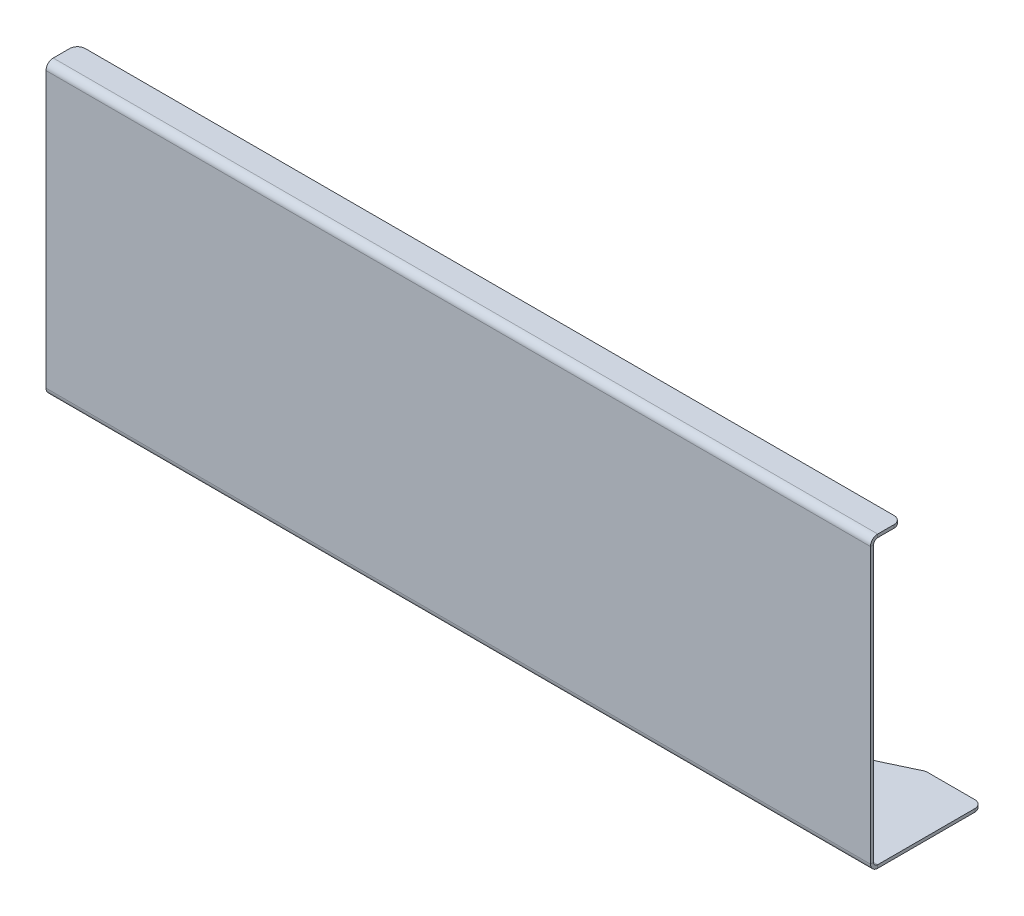
ISO-10303-21;
HEADER;
FILE_DESCRIPTION(('STEP AP214'),'2;1');
FILE_NAME('part.step','',(''),(''),'','','');
FILE_SCHEMA(('AUTOMOTIVE_DESIGN { 1 0 10303 214 1 1 1 1 }'));
ENDSEC;
DATA;
#1=APPLICATION_CONTEXT('core data for automotive mechanical design processes');
#2=APPLICATION_PROTOCOL_DEFINITION('international standard','automotive_design',2000,#1);
#3=PRODUCT_CONTEXT('',#1,'mechanical');
#4=PRODUCT('Part','Part','',(#3));
#5=PRODUCT_RELATED_PRODUCT_CATEGORY('part','',(#4));
#6=PRODUCT_DEFINITION_FORMATION('','',#4);
#7=PRODUCT_DEFINITION_CONTEXT('part definition',#1,'design');
#8=PRODUCT_DEFINITION('design','',#6,#7);
#9=PRODUCT_DEFINITION_SHAPE('','',#8);
#10=(LENGTH_UNIT() NAMED_UNIT(*) SI_UNIT(.MILLI.,.METRE.));
#11=(NAMED_UNIT(*) PLANE_ANGLE_UNIT() SI_UNIT($,.RADIAN.));
#12=(NAMED_UNIT(*) SI_UNIT($,.STERADIAN.) SOLID_ANGLE_UNIT());
#13=UNCERTAINTY_MEASURE_WITH_UNIT(LENGTH_MEASURE(1.E-05),#10,'distance_accuracy_value','');
#14=(GEOMETRIC_REPRESENTATION_CONTEXT(3) GLOBAL_UNCERTAINTY_ASSIGNED_CONTEXT((#13)) GLOBAL_UNIT_ASSIGNED_CONTEXT((#10,
#11,#12)) REPRESENTATION_CONTEXT('',''));
#15=CARTESIAN_POINT('',(0.,0.,0.));
#16=DIRECTION('',(0.,0.,1.));
#17=DIRECTION('',(1.,0.,0.));
#18=AXIS2_PLACEMENT_3D('',#15,#16,#17);
#19=CARTESIAN_POINT('',(-262.,4.60000000000005,-2.));
#20=DIRECTION('',(-1.,0.,0.));
#21=DIRECTION('',(0.,0.,1.));
#22=AXIS2_PLACEMENT_3D('',#19,#20,#21);
#23=PLANE('',#22);
#24=DIRECTION('',(0.,0.,-1.));
#25=VECTOR('',#24,1.);
#26=CARTESIAN_POINT('',(-262.,2.,0.));
#27=LINE('',#26,#25);
#28=CARTESIAN_POINT('',(-262.,2.,-4.60000000000005));
#29=VERTEX_POINT('',#28);
#30=CARTESIAN_POINT('',(-262.,2.,-66.2813416123875));
#31=VERTEX_POINT('',#30);
#32=EDGE_CURVE('E197',#29,#31,#27,.T.);
#33=ORIENTED_EDGE('',*,*,#32,.T.);
#34=DIRECTION('',(0.,-1.,0.));
#35=VECTOR('',#34,1.);
#36=CARTESIAN_POINT('',(-262.,4.60000000000005,-66.2813416123875));
#37=LINE('',#36,#35);
#38=CARTESIAN_POINT('',(-262.,0.,-66.2813416123875));
#39=VERTEX_POINT('',#38);
#40=EDGE_CURVE('E312',#31,#39,#37,.T.);
#41=ORIENTED_EDGE('',*,*,#40,.T.);
#42=DIRECTION('',(0.,0.,-1.));
#43=VECTOR('',#42,1.);
#44=CARTESIAN_POINT('',(-262.,0.,0.));
#45=LINE('',#44,#43);
#46=CARTESIAN_POINT('',(-262.,0.,-4.60000000000005));
#47=VERTEX_POINT('',#46);
#48=EDGE_CURVE('E231',#47,#39,#45,.T.);
#49=ORIENTED_EDGE('',*,*,#48,.F.);
#50=DIRECTION('',(0.,1.,0.));
#51=VECTOR('',#50,1.);
#52=CARTESIAN_POINT('',(-262.,0.,-4.60000000000005));
#53=LINE('',#52,#51);
#54=EDGE_CURVE('E188',#47,#29,#53,.T.);
#55=ORIENTED_EDGE('',*,*,#54,.T.);
#56=EDGE_LOOP('',(#33,#41,#49,#55));
#57=FACE_BOUND('',#56,.T.);
#58=ADVANCED_FACE('F38',(#57),#23,.T.);
#59=CARTESIAN_POINT('',(262.,4.60000000000005,-4.60000000000005));
#60=DIRECTION('',(1.,0.,0.));
#61=DIRECTION('',(0.,0.,-1.));
#62=AXIS2_PLACEMENT_3D('',#59,#60,#61);
#63=PLANE('',#62);
#64=DIRECTION('',(0.,0.,-1.));
#65=VECTOR('',#64,1.);
#66=CARTESIAN_POINT('',(262.,0.,0.));
#67=LINE('',#66,#65);
#68=CARTESIAN_POINT('',(262.,0.,-4.60000000000005));
#69=VERTEX_POINT('',#68);
#70=CARTESIAN_POINT('',(262.,0.,-66.2813416123875));
#71=VERTEX_POINT('',#70);
#72=EDGE_CURVE('E206',#69,#71,#67,.T.);
#73=ORIENTED_EDGE('',*,*,#72,.T.);
#74=DIRECTION('',(0.,-1.,0.));
#75=VECTOR('',#74,1.);
#76=CARTESIAN_POINT('',(262.,4.60000000000005,-66.2813416123875));
#77=LINE('',#76,#75);
#78=CARTESIAN_POINT('',(262.,2.,-66.2813416123875));
#79=VERTEX_POINT('',#78);
#80=EDGE_CURVE('E11',#71,#79,#77,.F.);
#81=ORIENTED_EDGE('',*,*,#80,.T.);
#82=DIRECTION('',(0.,0.,-1.));
#83=VECTOR('',#82,1.);
#84=CARTESIAN_POINT('',(262.,2.,0.));
#85=LINE('',#84,#83);
#86=CARTESIAN_POINT('',(262.,2.,-4.60000000000005));
#87=VERTEX_POINT('',#86);
#88=EDGE_CURVE('E195',#87,#79,#85,.T.);
#89=ORIENTED_EDGE('',*,*,#88,.F.);
#90=DIRECTION('',(0.,-1.,0.));
#91=VECTOR('',#90,1.);
#92=CARTESIAN_POINT('',(262.,2.,-4.60000000000005));
#93=LINE('',#92,#91);
#94=EDGE_CURVE('E175',#87,#69,#93,.T.);
#95=ORIENTED_EDGE('',*,*,#94,.T.);
#96=EDGE_LOOP('',(#73,#81,#89,#95));
#97=FACE_BOUND('',#96,.T.);
#98=ADVANCED_FACE('F204',(#97),#63,.T.);
#99=CARTESIAN_POINT('',(262.,4.60000000000005,0.));
#100=DIRECTION('',(1.,0.,0.));
#101=DIRECTION('',(0.,0.,-1.));
#102=AXIS2_PLACEMENT_3D('',#99,#100,#101);
#103=PLANE('',#102);
#104=DIRECTION('',(0.,0.,-1.));
#105=VECTOR('',#104,1.);
#106=CARTESIAN_POINT('',(262.,4.60000000000005,0.));
#107=LINE('',#106,#105);
#108=CARTESIAN_POINT('',(262.,4.60000000000005,0.));
#109=VERTEX_POINT('',#108);
#110=CARTESIAN_POINT('',(262.,4.60000000000005,-2.));
#111=VERTEX_POINT('',#110);
#112=EDGE_CURVE('E187',#109,#111,#107,.T.);
#113=ORIENTED_EDGE('',*,*,#112,.F.);
#114=CARTESIAN_POINT('',(262.,4.60000000000005,-4.60000000000005));
#115=DIRECTION('',(1.,0.,0.));
#116=DIRECTION('',(0.,0.,-1.));
#117=AXIS2_PLACEMENT_3D('',#114,#115,#116);
#118=CIRCLE('',#117,4.6);
#119=EDGE_CURVE('E182',#109,#69,#118,.T.);
#120=ORIENTED_EDGE('',*,*,#119,.T.);
#121=ORIENTED_EDGE('',*,*,#94,.F.);
#122=CARTESIAN_POINT('',(262.,4.60000000000005,-4.60000000000005));
#123=DIRECTION('',(1.,0.,0.));
#124=DIRECTION('',(0.,0.,-1.));
#125=AXIS2_PLACEMENT_3D('',#122,#123,#124);
#126=CIRCLE('',#125,2.6);
#127=EDGE_CURVE('E179',#111,#87,#126,.T.);
#128=ORIENTED_EDGE('',*,*,#127,.F.);
#129=EDGE_LOOP('',(#113,#120,#121,#128));
#130=FACE_BOUND('',#129,.T.);
#131=ADVANCED_FACE('F177',(#130),#103,.T.);
#132=CARTESIAN_POINT('',(262.,2.,-4.60000000000005));
#133=DIRECTION('',(1.,0.,0.));
#134=DIRECTION('',(0.,0.,-1.));
#135=AXIS2_PLACEMENT_3D('',#132,#133,#134);
#136=PLANE('',#135);
#137=DIRECTION('',(0.,-1.,0.));
#138=VECTOR('',#137,1.);
#139=CARTESIAN_POINT('',(262.,0.,0.));
#140=LINE('',#139,#138);
#141=CARTESIAN_POINT('',(262.,179.4,0.));
#142=VERTEX_POINT('',#141);
#143=EDGE_CURVE('E226',#142,#109,#140,.T.);
#144=ORIENTED_EDGE('',*,*,#143,.T.);
#145=ORIENTED_EDGE('',*,*,#112,.T.);
#146=DIRECTION('',(0.,1.,0.));
#147=VECTOR('',#146,1.);
#148=CARTESIAN_POINT('',(262.,0.,-2.));
#149=LINE('',#148,#147);
#150=CARTESIAN_POINT('',(262.,179.4,-2.));
#151=VERTEX_POINT('',#150);
#152=EDGE_CURVE('E211',#151,#111,#149,.F.);
#153=ORIENTED_EDGE('',*,*,#152,.F.);
#154=DIRECTION('',(0.,0.,1.));
#155=VECTOR('',#154,1.);
#156=CARTESIAN_POINT('',(262.,179.4,-2.));
#157=LINE('',#156,#155);
#158=EDGE_CURVE('E285',#151,#142,#157,.T.);
#159=ORIENTED_EDGE('',*,*,#158,.T.);
#160=EDGE_LOOP('',(#144,#145,#153,#159));
#161=FACE_BOUND('',#160,.T.);
#162=ADVANCED_FACE('F381',(#161),#136,.T.);
#163=CARTESIAN_POINT('',(-262.,0.,-4.60000000000005));
#164=DIRECTION('',(-1.,0.,0.));
#165=DIRECTION('',(0.,0.,1.));
#166=AXIS2_PLACEMENT_3D('',#163,#164,#165);
#167=PLANE('',#166);
#168=ORIENTED_EDGE('',*,*,#54,.F.);
#169=CARTESIAN_POINT('',(-262.,4.60000000000005,-4.60000000000005));
#170=DIRECTION('',(1.,0.,0.));
#171=DIRECTION('',(0.,0.,-1.));
#172=AXIS2_PLACEMENT_3D('',#169,#170,#171);
#173=CIRCLE('',#172,4.6);
#174=CARTESIAN_POINT('',(-262.,4.60000000000005,0.));
#175=VERTEX_POINT('',#174);
#176=EDGE_CURVE('E254',#175,#47,#173,.T.);
#177=ORIENTED_EDGE('',*,*,#176,.F.);
#178=DIRECTION('',(0.,0.,1.));
#179=VECTOR('',#178,1.);
#180=CARTESIAN_POINT('',(-262.,4.60000000000005,-2.));
#181=LINE('',#180,#179);
#182=CARTESIAN_POINT('',(-262.,4.60000000000005,-2.));
#183=VERTEX_POINT('',#182);
#184=EDGE_CURVE('E290',#183,#175,#181,.T.);
#185=ORIENTED_EDGE('',*,*,#184,.F.);
#186=CARTESIAN_POINT('',(-262.,4.60000000000005,-4.60000000000005));
#187=DIRECTION('',(1.,0.,0.));
#188=DIRECTION('',(0.,0.,-1.));
#189=AXIS2_PLACEMENT_3D('',#186,#187,#188);
#190=CIRCLE('',#189,2.6);
#191=EDGE_CURVE('E236',#183,#29,#190,.T.);
#192=ORIENTED_EDGE('',*,*,#191,.T.);
#193=EDGE_LOOP('',(#168,#177,#185,#192));
#194=FACE_BOUND('',#193,.T.);
#195=ADVANCED_FACE('F378',(#194),#167,.T.);
#196=CARTESIAN_POINT('',(262.,184.,-4.60000000000005));
#197=DIRECTION('',(1.,0.,0.));
#198=DIRECTION('',(0.,0.,-1.));
#199=AXIS2_PLACEMENT_3D('',#196,#197,#198);
#200=PLANE('',#199);
#201=DIRECTION('',(0.,-1.,0.));
#202=VECTOR('',#201,1.);
#203=CARTESIAN_POINT('',(262.,184.,-4.60000000000005));
#204=LINE('',#203,#202);
#205=CARTESIAN_POINT('',(262.,184.,-4.60000000000005));
#206=VERTEX_POINT('',#205);
#207=CARTESIAN_POINT('',(262.,182.,-4.60000000000005));
#208=VERTEX_POINT('',#207);
#209=EDGE_CURVE('E287',#206,#208,#204,.T.);
#210=ORIENTED_EDGE('',*,*,#209,.F.);
#211=CARTESIAN_POINT('',(262.,179.4,-4.60000000000005));
#212=DIRECTION('',(1.,0.,0.));
#213=DIRECTION('',(0.,0.,-1.));
#214=AXIS2_PLACEMENT_3D('',#211,#212,#213);
#215=CIRCLE('',#214,4.6);
#216=EDGE_CURVE('E223',#206,#142,#215,.T.);
#217=ORIENTED_EDGE('',*,*,#216,.T.);
#218=ORIENTED_EDGE('',*,*,#158,.F.);
#219=CARTESIAN_POINT('',(262.,179.4,-4.60000000000005));
#220=DIRECTION('',(1.,0.,0.));
#221=DIRECTION('',(0.,0.,-1.));
#222=AXIS2_PLACEMENT_3D('',#219,#220,#221);
#223=CIRCLE('',#222,2.6);
#224=EDGE_CURVE('E213',#208,#151,#223,.T.);
#225=ORIENTED_EDGE('',*,*,#224,.F.);
#226=EDGE_LOOP('',(#210,#217,#218,#225));
#227=FACE_BOUND('',#226,.T.);
#228=ADVANCED_FACE('F376',(#227),#200,.T.);
#229=CARTESIAN_POINT('',(262.,179.4,-2.));
#230=DIRECTION('',(1.,0.,0.));
#231=DIRECTION('',(0.,0.,-1.));
#232=AXIS2_PLACEMENT_3D('',#229,#230,#231);
#233=PLANE('',#232);
#234=DIRECTION('',(0.,0.,-1.));
#235=VECTOR('',#234,1.);
#236=CARTESIAN_POINT('',(262.,182.,0.));
#237=LINE('',#236,#235);
#238=CARTESIAN_POINT('',(262.,182.,-15.));
#239=VERTEX_POINT('',#238);
#240=EDGE_CURVE('E219',#239,#208,#237,.F.);
#241=ORIENTED_EDGE('',*,*,#240,.F.);
#242=DIRECTION('',(0.,-1.,0.));
#243=VECTOR('',#242,1.);
#244=CARTESIAN_POINT('',(262.,179.4,-15.));
#245=LINE('',#244,#243);
#246=CARTESIAN_POINT('',(262.,184.,-15.));
#247=VERTEX_POINT('',#246);
#248=EDGE_CURVE('E303',#239,#247,#245,.F.);
#249=ORIENTED_EDGE('',*,*,#248,.T.);
#250=DIRECTION('',(0.,0.,1.));
#251=VECTOR('',#250,1.);
#252=CARTESIAN_POINT('',(262.,184.,0.));
#253=LINE('',#252,#251);
#254=EDGE_CURVE('E221',#247,#206,#253,.T.);
#255=ORIENTED_EDGE('',*,*,#254,.T.);
#256=ORIENTED_EDGE('',*,*,#209,.T.);
#257=EDGE_LOOP('',(#241,#249,#255,#256));
#258=FACE_BOUND('',#257,.T.);
#259=ADVANCED_FACE('F483',(#258),#233,.T.);
#260=CARTESIAN_POINT('',(-262.,179.4,0.));
#261=DIRECTION('',(-1.,0.,0.));
#262=DIRECTION('',(0.,0.,1.));
#263=AXIS2_PLACEMENT_3D('',#260,#261,#262);
#264=PLANE('',#263);
#265=DIRECTION('',(0.,0.,-1.));
#266=VECTOR('',#265,1.);
#267=CARTESIAN_POINT('',(-262.,179.4,0.));
#268=LINE('',#267,#266);
#269=CARTESIAN_POINT('',(-262.,179.4,0.));
#270=VERTEX_POINT('',#269);
#271=CARTESIAN_POINT('',(-262.,179.4,-2.));
#272=VERTEX_POINT('',#271);
#273=EDGE_CURVE('E283',#270,#272,#268,.T.);
#274=ORIENTED_EDGE('',*,*,#273,.F.);
#275=CARTESIAN_POINT('',(-262.,179.4,-4.60000000000005));
#276=DIRECTION('',(1.,0.,0.));
#277=DIRECTION('',(0.,0.,-1.));
#278=AXIS2_PLACEMENT_3D('',#275,#276,#277);
#279=CIRCLE('',#278,4.6);
#280=CARTESIAN_POINT('',(-262.,184.,-4.60000000000005));
#281=VERTEX_POINT('',#280);
#282=EDGE_CURVE('E248',#281,#270,#279,.T.);
#283=ORIENTED_EDGE('',*,*,#282,.F.);
#284=DIRECTION('',(0.,1.,0.));
#285=VECTOR('',#284,1.);
#286=CARTESIAN_POINT('',(-262.,182.,-4.60000000000005));
#287=LINE('',#286,#285);
#288=CARTESIAN_POINT('',(-262.,182.,-4.60000000000005));
#289=VERTEX_POINT('',#288);
#290=EDGE_CURVE('E201',#289,#281,#287,.T.);
#291=ORIENTED_EDGE('',*,*,#290,.F.);
#292=CARTESIAN_POINT('',(-262.,179.4,-4.60000000000005));
#293=DIRECTION('',(1.,0.,0.));
#294=DIRECTION('',(0.,0.,-1.));
#295=AXIS2_PLACEMENT_3D('',#292,#293,#294);
#296=CIRCLE('',#295,2.6);
#297=EDGE_CURVE('E241',#289,#272,#296,.T.);
#298=ORIENTED_EDGE('',*,*,#297,.T.);
#299=EDGE_LOOP('',(#274,#283,#291,#298));
#300=FACE_BOUND('',#299,.T.);
#301=ADVANCED_FACE('F480',(#300),#264,.T.);
#302=CARTESIAN_POINT('',(-262.,182.,-4.60000000000005));
#303=DIRECTION('',(-1.,0.,0.));
#304=DIRECTION('',(0.,0.,1.));
#305=AXIS2_PLACEMENT_3D('',#302,#303,#304);
#306=PLANE('',#305);
#307=DIRECTION('',(0.,-1.,0.));
#308=VECTOR('',#307,1.);
#309=CARTESIAN_POINT('',(-262.,0.,0.));
#310=LINE('',#309,#308);
#311=EDGE_CURVE('E251',#270,#175,#310,.T.);
#312=ORIENTED_EDGE('',*,*,#311,.F.);
#313=ORIENTED_EDGE('',*,*,#273,.T.);
#314=DIRECTION('',(0.,1.,0.));
#315=VECTOR('',#314,1.);
#316=CARTESIAN_POINT('',(-262.,0.,-2.));
#317=LINE('',#316,#315);
#318=EDGE_CURVE('E238',#272,#183,#317,.F.);
#319=ORIENTED_EDGE('',*,*,#318,.T.);
#320=ORIENTED_EDGE('',*,*,#184,.T.);
#321=EDGE_LOOP('',(#312,#313,#319,#320));
#322=FACE_BOUND('',#321,.T.);
#323=ADVANCED_FACE('F477',(#322),#306,.T.);
#324=CARTESIAN_POINT('',(262.,0.,0.));
#325=DIRECTION('',(0.,1.,0.));
#326=DIRECTION('',(0.,0.,1.));
#327=AXIS2_PLACEMENT_3D('',#324,#325,#326);
#328=PLANE('',#327);
#329=ORIENTED_EDGE('',*,*,#48,.T.);
#330=CARTESIAN_POINT('',(-257.,0.,-66.2813416123875));
#331=DIRECTION('',(0.,1.,0.));
#332=DIRECTION('',(0.,0.,1.));
#333=AXIS2_PLACEMENT_3D('',#330,#331,#332);
#334=CIRCLE('',#333,5.);
#335=CARTESIAN_POINT('',(-257.,0.,-71.2813416123875));
#336=VERTEX_POINT('',#335);
#337=EDGE_CURVE('E321',#39,#336,#334,.F.);
#338=ORIENTED_EDGE('',*,*,#337,.T.);
#339=DIRECTION('',(1.,0.,0.));
#340=VECTOR('',#339,1.);
#341=CARTESIAN_POINT('',(-262.,0.,-71.2813416123875));
#342=LINE('',#341,#340);
#343=CARTESIAN_POINT('',(-226.953887564455,0.,-71.2813416123875));
#344=VERTEX_POINT('',#343);
#345=EDGE_CURVE('E357',#336,#344,#342,.T.);
#346=ORIENTED_EDGE('',*,*,#345,.T.);
#347=CARTESIAN_POINT('',(-226.953887564455,0.,-66.2813416123874));
#348=DIRECTION('',(0.,1.,0.));
#349=DIRECTION('',(0.,0.,1.));
#350=AXIS2_PLACEMENT_3D('',#347,#348,#349);
#351=CIRCLE('',#350,5.);
#352=CARTESIAN_POINT('',(-224.728849451078,0.,-70.7589755181483));
#353=VERTEX_POINT('',#352);
#354=EDGE_CURVE('E319',#344,#353,#351,.F.);
#355=ORIENTED_EDGE('',*,*,#354,.T.);
#356=CARTESIAN_POINT('',(0.,0.,-523.));
#357=DIRECTION('',(0.,1.,0.));
#358=DIRECTION('',(0.,0.,1.));
#359=AXIS2_PLACEMENT_3D('',#356,#357,#358);
#360=CIRCLE('',#359,505.);
#361=CARTESIAN_POINT('',(224.728849451078,0.,-70.7589755181484));
#362=VERTEX_POINT('',#361);
#363=EDGE_CURVE('E352',#353,#362,#360,.T.);
#364=ORIENTED_EDGE('',*,*,#363,.T.);
#365=CARTESIAN_POINT('',(226.953887564455,0.,-66.2813416123875));
#366=DIRECTION('',(0.,1.,0.));
#367=DIRECTION('',(0.,0.,1.));
#368=AXIS2_PLACEMENT_3D('',#365,#366,#367);
#369=CIRCLE('',#368,5.);
#370=CARTESIAN_POINT('',(226.953887564455,0.,-71.2813416123875));
#371=VERTEX_POINT('',#370);
#372=EDGE_CURVE('E317',#362,#371,#369,.F.);
#373=ORIENTED_EDGE('',*,*,#372,.T.);
#374=DIRECTION('',(1.,0.,0.));
#375=VECTOR('',#374,1.);
#376=CARTESIAN_POINT('',(262.,0.,-71.2813416123875));
#377=LINE('',#376,#375);
#378=CARTESIAN_POINT('',(257.,0.,-71.2813416123875));
#379=VERTEX_POINT('',#378);
#380=EDGE_CURVE('E345',#371,#379,#377,.T.);
#381=ORIENTED_EDGE('',*,*,#380,.T.);
#382=CARTESIAN_POINT('',(257.,0.,-66.2813416123875));
#383=DIRECTION('',(0.,1.,0.));
#384=DIRECTION('',(0.,0.,1.));
#385=AXIS2_PLACEMENT_3D('',#382,#383,#384);
#386=CIRCLE('',#385,5.);
#387=EDGE_CURVE('E315',#379,#71,#386,.F.);
#388=ORIENTED_EDGE('',*,*,#387,.T.);
#389=ORIENTED_EDGE('',*,*,#72,.F.);
#390=DIRECTION('',(-1.,0.,0.));
#391=VECTOR('',#390,1.);
#392=CARTESIAN_POINT('',(262.,0.,-4.60000000000005));
#393=LINE('',#392,#391);
#394=EDGE_CURVE('E230',#69,#47,#393,.T.);
#395=ORIENTED_EDGE('',*,*,#394,.T.);
#396=EDGE_LOOP('',(#329,#338,#346,#355,#364,#373,#381,#388,#389,#395));
#397=FACE_BOUND('',#396,.T.);
#398=ADVANCED_FACE('F348',(#397),#328,.F.);
#399=CARTESIAN_POINT('',(262.,2.,0.));
#400=DIRECTION('',(0.,1.,0.));
#401=DIRECTION('',(0.,0.,1.));
#402=AXIS2_PLACEMENT_3D('',#399,#400,#401);
#403=PLANE('',#402);
#404=DIRECTION('',(1.,0.,0.));
#405=VECTOR('',#404,1.);
#406=CARTESIAN_POINT('',(-262.,2.,-71.2813416123875));
#407=LINE('',#406,#405);
#408=CARTESIAN_POINT('',(-257.,2.,-71.2813416123875));
#409=VERTEX_POINT('',#408);
#410=CARTESIAN_POINT('',(-226.953887564455,2.,-71.2813416123875));
#411=VERTEX_POINT('',#410);
#412=EDGE_CURVE('E351',#409,#411,#407,.T.);
#413=ORIENTED_EDGE('',*,*,#412,.F.);
#414=CARTESIAN_POINT('',(-257.,2.,-66.2813416123875));
#415=DIRECTION('',(0.,1.,0.));
#416=DIRECTION('',(0.,0.,1.));
#417=AXIS2_PLACEMENT_3D('',#414,#415,#416);
#418=CIRCLE('',#417,5.);
#419=EDGE_CURVE('E333',#409,#31,#418,.T.);
#420=ORIENTED_EDGE('',*,*,#419,.T.);
#421=ORIENTED_EDGE('',*,*,#32,.F.);
#422=DIRECTION('',(-1.,0.,0.));
#423=VECTOR('',#422,1.);
#424=CARTESIAN_POINT('',(262.,2.,-4.60000000000005));
#425=LINE('',#424,#423);
#426=EDGE_CURVE('E192',#87,#29,#425,.T.);
#427=ORIENTED_EDGE('',*,*,#426,.F.);
#428=ORIENTED_EDGE('',*,*,#88,.T.);
#429=CARTESIAN_POINT('',(257.,2.,-66.2813416123875));
#430=DIRECTION('',(0.,1.,0.));
#431=DIRECTION('',(0.,0.,1.));
#432=AXIS2_PLACEMENT_3D('',#429,#430,#431);
#433=CIRCLE('',#432,5.);
#434=CARTESIAN_POINT('',(257.,2.,-71.2813416123875));
#435=VERTEX_POINT('',#434);
#436=EDGE_CURVE('E53',#79,#435,#433,.T.);
#437=ORIENTED_EDGE('',*,*,#436,.T.);
#438=DIRECTION('',(1.,0.,0.));
#439=VECTOR('',#438,1.);
#440=CARTESIAN_POINT('',(262.,2.,-71.2813416123875));
#441=LINE('',#440,#439);
#442=CARTESIAN_POINT('',(226.953887564455,2.,-71.2813416123875));
#443=VERTEX_POINT('',#442);
#444=EDGE_CURVE('E234',#443,#435,#441,.T.);
#445=ORIENTED_EDGE('',*,*,#444,.F.);
#446=CARTESIAN_POINT('',(226.953887564455,2.,-66.2813416123875));
#447=DIRECTION('',(0.,1.,0.));
#448=DIRECTION('',(0.,0.,1.));
#449=AXIS2_PLACEMENT_3D('',#446,#447,#448);
#450=CIRCLE('',#449,5.);
#451=CARTESIAN_POINT('',(224.728849451078,2.,-70.7589755181484));
#452=VERTEX_POINT('',#451);
#453=EDGE_CURVE('E329',#443,#452,#450,.T.);
#454=ORIENTED_EDGE('',*,*,#453,.T.);
#455=CARTESIAN_POINT('',(0.,2.,-523.));
#456=DIRECTION('',(0.,1.,0.));
#457=DIRECTION('',(0.,0.,1.));
#458=AXIS2_PLACEMENT_3D('',#455,#456,#457);
#459=CIRCLE('',#458,505.);
#460=CARTESIAN_POINT('',(-224.728849451078,2.,-70.7589755181483));
#461=VERTEX_POINT('',#460);
#462=EDGE_CURVE('E355',#461,#452,#459,.T.);
#463=ORIENTED_EDGE('',*,*,#462,.F.);
#464=CARTESIAN_POINT('',(-226.953887564455,2.,-66.2813416123874));
#465=DIRECTION('',(0.,1.,0.));
#466=DIRECTION('',(0.,0.,1.));
#467=AXIS2_PLACEMENT_3D('',#464,#465,#466);
#468=CIRCLE('',#467,5.);
#469=EDGE_CURVE('E331',#461,#411,#468,.T.);
#470=ORIENTED_EDGE('',*,*,#469,.T.);
#471=EDGE_LOOP('',(#413,#420,#421,#427,#428,#437,#445,#454,#463,#470));
#472=FACE_BOUND('',#471,.T.);
#473=ADVANCED_FACE('F194',(#472),#403,.T.);
#474=CARTESIAN_POINT('',(262.,4.60000000000005,-4.60000000000005));
#475=DIRECTION('',(-1.,0.,0.));
#476=DIRECTION('',(0.,0.,1.));
#477=AXIS2_PLACEMENT_3D('',#474,#475,#476);
#478=CYLINDRICAL_SURFACE('',#477,2.6);
#479=ORIENTED_EDGE('',*,*,#191,.F.);
#480=DIRECTION('',(-1.,0.,0.));
#481=VECTOR('',#480,1.);
#482=CARTESIAN_POINT('',(262.,4.60000000000005,-2.));
#483=LINE('',#482,#481);
#484=EDGE_CURVE('E202',#111,#183,#483,.T.);
#485=ORIENTED_EDGE('',*,*,#484,.F.);
#486=ORIENTED_EDGE('',*,*,#127,.T.);
#487=ORIENTED_EDGE('',*,*,#426,.T.);
#488=EDGE_LOOP('',(#479,#485,#486,#487));
#489=FACE_BOUND('',#488,.T.);
#490=ADVANCED_FACE('F209',(#489),#478,.F.);
#491=CARTESIAN_POINT('',(262.,0.,-2.));
#492=DIRECTION('',(0.,0.,-1.));
#493=DIRECTION('',(-1.,0.,0.));
#494=AXIS2_PLACEMENT_3D('',#491,#492,#493);
#495=PLANE('',#494);
#496=ORIENTED_EDGE('',*,*,#318,.F.);
#497=DIRECTION('',(-1.,0.,0.));
#498=VECTOR('',#497,1.);
#499=CARTESIAN_POINT('',(262.,179.4,-2.));
#500=LINE('',#499,#498);
#501=EDGE_CURVE('E277',#151,#272,#500,.T.);
#502=ORIENTED_EDGE('',*,*,#501,.F.);
#503=ORIENTED_EDGE('',*,*,#152,.T.);
#504=ORIENTED_EDGE('',*,*,#484,.T.);
#505=EDGE_LOOP('',(#496,#502,#503,#504));
#506=FACE_BOUND('',#505,.T.);
#507=ADVANCED_FACE('F466',(#506),#495,.T.);
#508=CARTESIAN_POINT('',(262.,179.4,-4.60000000000005));
#509=DIRECTION('',(-1.,0.,0.));
#510=DIRECTION('',(0.,0.,1.));
#511=AXIS2_PLACEMENT_3D('',#508,#509,#510);
#512=CYLINDRICAL_SURFACE('',#511,2.6);
#513=ORIENTED_EDGE('',*,*,#297,.F.);
#514=DIRECTION('',(-1.,0.,0.));
#515=VECTOR('',#514,1.);
#516=CARTESIAN_POINT('',(262.,182.,-4.60000000000005));
#517=LINE('',#516,#515);
#518=EDGE_CURVE('E274',#208,#289,#517,.T.);
#519=ORIENTED_EDGE('',*,*,#518,.F.);
#520=ORIENTED_EDGE('',*,*,#224,.T.);
#521=ORIENTED_EDGE('',*,*,#501,.T.);
#522=EDGE_LOOP('',(#513,#519,#520,#521));
#523=FACE_BOUND('',#522,.T.);
#524=ADVANCED_FACE('F462',(#523),#512,.F.);
#525=CARTESIAN_POINT('',(262.,182.,0.));
#526=DIRECTION('',(0.,-1.,0.));
#527=DIRECTION('',(0.,0.,-1.));
#528=AXIS2_PLACEMENT_3D('',#525,#526,#527);
#529=PLANE('',#528);
#530=DIRECTION('',(-1.,0.,0.));
#531=VECTOR('',#530,1.);
#532=CARTESIAN_POINT('',(262.,182.,-20.));
#533=LINE('',#532,#531);
#534=CARTESIAN_POINT('',(257.,182.,-20.));
#535=VERTEX_POINT('',#534);
#536=CARTESIAN_POINT('',(-257.,182.,-20.));
#537=VERTEX_POINT('',#536);
#538=EDGE_CURVE('E271',#535,#537,#533,.T.);
#539=ORIENTED_EDGE('',*,*,#538,.F.);
#540=CARTESIAN_POINT('',(257.,182.,-15.));
#541=DIRECTION('',(0.,-1.,0.));
#542=DIRECTION('',(0.,0.,-1.));
#543=AXIS2_PLACEMENT_3D('',#540,#541,#542);
#544=CIRCLE('',#543,5.);
#545=EDGE_CURVE('E301',#535,#239,#544,.T.);
#546=ORIENTED_EDGE('',*,*,#545,.T.);
#547=ORIENTED_EDGE('',*,*,#240,.T.);
#548=ORIENTED_EDGE('',*,*,#518,.T.);
#549=DIRECTION('',(0.,0.,-1.));
#550=VECTOR('',#549,1.);
#551=CARTESIAN_POINT('',(-262.,182.,0.));
#552=LINE('',#551,#550);
#553=CARTESIAN_POINT('',(-262.,182.,-15.));
#554=VERTEX_POINT('',#553);
#555=EDGE_CURVE('E244',#554,#289,#552,.F.);
#556=ORIENTED_EDGE('',*,*,#555,.F.);
#557=CARTESIAN_POINT('',(-257.,182.,-15.));
#558=DIRECTION('',(0.,-1.,0.));
#559=DIRECTION('',(0.,0.,-1.));
#560=AXIS2_PLACEMENT_3D('',#557,#558,#559);
#561=CIRCLE('',#560,5.);
#562=EDGE_CURVE('E299',#554,#537,#561,.T.);
#563=ORIENTED_EDGE('',*,*,#562,.T.);
#564=EDGE_LOOP('',(#539,#546,#547,#548,#556,#563));
#565=FACE_BOUND('',#564,.T.);
#566=ADVANCED_FACE('F458',(#565),#529,.T.);
#567=CARTESIAN_POINT('',(262.,184.,-20.));
#568=DIRECTION('',(0.,0.,-1.));
#569=DIRECTION('',(-1.,0.,0.));
#570=AXIS2_PLACEMENT_3D('',#567,#568,#569);
#571=PLANE('',#570);
#572=DIRECTION('',(-1.,0.,0.));
#573=VECTOR('',#572,1.);
#574=CARTESIAN_POINT('',(262.,184.,-20.));
#575=LINE('',#574,#573);
#576=CARTESIAN_POINT('',(257.,184.,-20.));
#577=VERTEX_POINT('',#576);
#578=CARTESIAN_POINT('',(-257.,184.,-20.));
#579=VERTEX_POINT('',#578);
#580=EDGE_CURVE('E268',#577,#579,#575,.T.);
#581=ORIENTED_EDGE('',*,*,#580,.F.);
#582=DIRECTION('',(0.,-1.,0.));
#583=VECTOR('',#582,1.);
#584=CARTESIAN_POINT('',(257.,184.,-20.));
#585=LINE('',#584,#583);
#586=EDGE_CURVE('E296',#577,#535,#585,.T.);
#587=ORIENTED_EDGE('',*,*,#586,.T.);
#588=ORIENTED_EDGE('',*,*,#538,.T.);
#589=DIRECTION('',(0.,-1.,0.));
#590=VECTOR('',#589,1.);
#591=CARTESIAN_POINT('',(-257.,184.,-20.));
#592=LINE('',#591,#590);
#593=EDGE_CURVE('E294',#537,#579,#592,.F.);
#594=ORIENTED_EDGE('',*,*,#593,.T.);
#595=EDGE_LOOP('',(#581,#587,#588,#594));
#596=FACE_BOUND('',#595,.T.);
#597=ADVANCED_FACE('F454',(#596),#571,.T.);
#598=CARTESIAN_POINT('',(262.,184.,0.));
#599=DIRECTION('',(0.,-1.,0.));
#600=DIRECTION('',(0.,0.,-1.));
#601=AXIS2_PLACEMENT_3D('',#598,#599,#600);
#602=PLANE('',#601);
#603=ORIENTED_EDGE('',*,*,#254,.F.);
#604=CARTESIAN_POINT('',(257.,184.,-15.));
#605=DIRECTION('',(0.,-1.,0.));
#606=DIRECTION('',(0.,0.,-1.));
#607=AXIS2_PLACEMENT_3D('',#604,#605,#606);
#608=CIRCLE('',#607,5.);
#609=EDGE_CURVE('E307',#247,#577,#608,.F.);
#610=ORIENTED_EDGE('',*,*,#609,.T.);
#611=ORIENTED_EDGE('',*,*,#580,.T.);
#612=CARTESIAN_POINT('',(-257.,184.,-15.));
#613=DIRECTION('',(0.,-1.,0.));
#614=DIRECTION('',(0.,0.,-1.));
#615=AXIS2_PLACEMENT_3D('',#612,#613,#614);
#616=CIRCLE('',#615,5.);
#617=CARTESIAN_POINT('',(-262.,184.,-15.));
#618=VERTEX_POINT('',#617);
#619=EDGE_CURVE('E305',#579,#618,#616,.F.);
#620=ORIENTED_EDGE('',*,*,#619,.T.);
#621=DIRECTION('',(0.,0.,1.));
#622=VECTOR('',#621,1.);
#623=CARTESIAN_POINT('',(-262.,184.,0.));
#624=LINE('',#623,#622);
#625=EDGE_CURVE('E246',#618,#281,#624,.T.);
#626=ORIENTED_EDGE('',*,*,#625,.T.);
#627=DIRECTION('',(-1.,0.,0.));
#628=VECTOR('',#627,1.);
#629=CARTESIAN_POINT('',(262.,184.,-4.60000000000005));
#630=LINE('',#629,#628);
#631=EDGE_CURVE('E265',#206,#281,#630,.T.);
#632=ORIENTED_EDGE('',*,*,#631,.F.);
#633=EDGE_LOOP('',(#603,#610,#611,#620,#626,#632));
#634=FACE_BOUND('',#633,.T.);
#635=ADVANCED_FACE('F450',(#634),#602,.F.);
#636=CARTESIAN_POINT('',(262.,179.4,-4.60000000000005));
#637=DIRECTION('',(-1.,0.,0.));
#638=DIRECTION('',(0.,0.,1.));
#639=AXIS2_PLACEMENT_3D('',#636,#637,#638);
#640=CYLINDRICAL_SURFACE('',#639,4.6);
#641=ORIENTED_EDGE('',*,*,#282,.T.);
#642=DIRECTION('',(-1.,0.,0.));
#643=VECTOR('',#642,1.);
#644=CARTESIAN_POINT('',(262.,179.4,0.));
#645=LINE('',#644,#643);
#646=EDGE_CURVE('E262',#142,#270,#645,.T.);
#647=ORIENTED_EDGE('',*,*,#646,.F.);
#648=ORIENTED_EDGE('',*,*,#216,.F.);
#649=ORIENTED_EDGE('',*,*,#631,.T.);
#650=EDGE_LOOP('',(#641,#647,#648,#649));
#651=FACE_BOUND('',#650,.T.);
#652=ADVANCED_FACE('F446',(#651),#640,.T.);
#653=CARTESIAN_POINT('',(262.,0.,0.));
#654=DIRECTION('',(0.,0.,-1.));
#655=DIRECTION('',(-1.,0.,0.));
#656=AXIS2_PLACEMENT_3D('',#653,#654,#655);
#657=PLANE('',#656);
#658=ORIENTED_EDGE('',*,*,#311,.T.);
#659=DIRECTION('',(-1.,0.,0.));
#660=VECTOR('',#659,1.);
#661=CARTESIAN_POINT('',(262.,4.60000000000005,0.));
#662=LINE('',#661,#660);
#663=EDGE_CURVE('E259',#109,#175,#662,.T.);
#664=ORIENTED_EDGE('',*,*,#663,.F.);
#665=ORIENTED_EDGE('',*,*,#143,.F.);
#666=ORIENTED_EDGE('',*,*,#646,.T.);
#667=EDGE_LOOP('',(#658,#664,#665,#666));
#668=FACE_BOUND('',#667,.T.);
#669=ADVANCED_FACE('F443',(#668),#657,.F.);
#670=CARTESIAN_POINT('',(262.,4.60000000000005,-4.60000000000005));
#671=DIRECTION('',(-1.,0.,0.));
#672=DIRECTION('',(0.,0.,1.));
#673=AXIS2_PLACEMENT_3D('',#670,#671,#672);
#674=CYLINDRICAL_SURFACE('',#673,4.6);
#675=ORIENTED_EDGE('',*,*,#176,.T.);
#676=ORIENTED_EDGE('',*,*,#394,.F.);
#677=ORIENTED_EDGE('',*,*,#119,.F.);
#678=ORIENTED_EDGE('',*,*,#663,.T.);
#679=EDGE_LOOP('',(#675,#676,#677,#678));
#680=FACE_BOUND('',#679,.T.);
#681=ADVANCED_FACE('F419',(#680),#674,.T.);
#682=CARTESIAN_POINT('',(-262.,4.60000000000005,-4.60000000000005));
#683=DIRECTION('',(1.,0.,0.));
#684=DIRECTION('',(0.,0.,-1.));
#685=AXIS2_PLACEMENT_3D('',#682,#683,#684);
#686=PLANE('',#685);
#687=ORIENTED_EDGE('',*,*,#625,.F.);
#688=DIRECTION('',(0.,-1.,0.));
#689=VECTOR('',#688,1.);
#690=CARTESIAN_POINT('',(-262.,182.,-15.));
#691=LINE('',#690,#689);
#692=EDGE_CURVE('E309',#618,#554,#691,.T.);
#693=ORIENTED_EDGE('',*,*,#692,.T.);
#694=ORIENTED_EDGE('',*,*,#555,.T.);
#695=ORIENTED_EDGE('',*,*,#290,.T.);
#696=EDGE_LOOP('',(#687,#693,#694,#695));
#697=FACE_BOUND('',#696,.T.);
#698=ADVANCED_FACE('F435',(#697),#686,.F.);
#699=CARTESIAN_POINT('',(-262.,2.,-71.2813416123875));
#700=DIRECTION('',(0.,0.,-1.));
#701=DIRECTION('',(-1.,0.,0.));
#702=AXIS2_PLACEMENT_3D('',#699,#700,#701);
#703=PLANE('',#702);
#704=ORIENTED_EDGE('',*,*,#345,.F.);
#705=DIRECTION('',(0.,-1.,0.));
#706=VECTOR('',#705,1.);
#707=CARTESIAN_POINT('',(-257.,2.,-71.2813416123875));
#708=LINE('',#707,#706);
#709=EDGE_CURVE('E326',#336,#409,#708,.F.);
#710=ORIENTED_EDGE('',*,*,#709,.T.);
#711=ORIENTED_EDGE('',*,*,#412,.T.);
#712=DIRECTION('',(0.,-1.,0.));
#713=VECTOR('',#712,1.);
#714=CARTESIAN_POINT('',(-226.953887564455,2.,-71.2813416123875));
#715=LINE('',#714,#713);
#716=EDGE_CURVE('E323',#411,#344,#715,.T.);
#717=ORIENTED_EDGE('',*,*,#716,.T.);
#718=EDGE_LOOP('',(#704,#710,#711,#717));
#719=FACE_BOUND('',#718,.T.);
#720=ADVANCED_FACE('F412',(#719),#703,.T.);
#721=CARTESIAN_POINT('',(0.,2.,-523.));
#722=DIRECTION('',(0.,-1.,0.));
#723=DIRECTION('',(0.,0.,-1.));
#724=AXIS2_PLACEMENT_3D('',#721,#722,#723);
#725=CYLINDRICAL_SURFACE('',#724,505.);
#726=ORIENTED_EDGE('',*,*,#363,.F.);
#727=DIRECTION('',(0.,-1.,0.));
#728=VECTOR('',#727,1.);
#729=CARTESIAN_POINT('',(-224.728849451078,2.,-70.7589755181483));
#730=LINE('',#729,#728);
#731=EDGE_CURVE('E338',#353,#461,#730,.F.);
#732=ORIENTED_EDGE('',*,*,#731,.T.);
#733=ORIENTED_EDGE('',*,*,#462,.T.);
#734=DIRECTION('',(0.,-1.,0.));
#735=VECTOR('',#734,1.);
#736=CARTESIAN_POINT('',(224.728849451078,2.,-70.7589755181484));
#737=LINE('',#736,#735);
#738=EDGE_CURVE('E335',#452,#362,#737,.T.);
#739=ORIENTED_EDGE('',*,*,#738,.T.);
#740=EDGE_LOOP('',(#726,#732,#733,#739));
#741=FACE_BOUND('',#740,.T.);
#742=ADVANCED_FACE('F426',(#741),#725,.F.);
#743=CARTESIAN_POINT('',(262.,2.,-71.2813416123875));
#744=DIRECTION('',(0.,0.,-1.));
#745=DIRECTION('',(-1.,0.,0.));
#746=AXIS2_PLACEMENT_3D('',#743,#744,#745);
#747=PLANE('',#746);
#748=ORIENTED_EDGE('',*,*,#380,.F.);
#749=DIRECTION('',(0.,-1.,0.));
#750=VECTOR('',#749,1.);
#751=CARTESIAN_POINT('',(226.953887564455,2.,-71.2813416123875));
#752=LINE('',#751,#750);
#753=EDGE_CURVE('E46',#371,#443,#752,.F.);
#754=ORIENTED_EDGE('',*,*,#753,.T.);
#755=ORIENTED_EDGE('',*,*,#444,.T.);
#756=DIRECTION('',(0.,-1.,0.));
#757=VECTOR('',#756,1.);
#758=CARTESIAN_POINT('',(257.,2.,-71.2813416123875));
#759=LINE('',#758,#757);
#760=EDGE_CURVE('E340',#435,#379,#759,.T.);
#761=ORIENTED_EDGE('',*,*,#760,.T.);
#762=EDGE_LOOP('',(#748,#754,#755,#761));
#763=FACE_BOUND('',#762,.T.);
#764=ADVANCED_FACE('F344',(#763),#747,.T.);
#765=CARTESIAN_POINT('',(257.,184.,-15.));
#766=DIRECTION('',(0.,-1.,0.));
#767=DIRECTION('',(0.,0.,-1.));
#768=AXIS2_PLACEMENT_3D('',#765,#766,#767);
#769=CYLINDRICAL_SURFACE('',#768,5.);
#770=ORIENTED_EDGE('',*,*,#609,.F.);
#771=ORIENTED_EDGE('',*,*,#248,.F.);
#772=ORIENTED_EDGE('',*,*,#545,.F.);
#773=ORIENTED_EDGE('',*,*,#586,.F.);
#774=EDGE_LOOP('',(#770,#771,#772,#773));
#775=FACE_BOUND('',#774,.T.);
#776=ADVANCED_FACE('F388',(#775),#769,.T.);
#777=CARTESIAN_POINT('',(-257.,4.60000000000005,-15.));
#778=DIRECTION('',(0.,1.,0.));
#779=DIRECTION('',(0.,0.,1.));
#780=AXIS2_PLACEMENT_3D('',#777,#778,#779);
#781=CYLINDRICAL_SURFACE('',#780,5.);
#782=ORIENTED_EDGE('',*,*,#619,.F.);
#783=ORIENTED_EDGE('',*,*,#593,.F.);
#784=ORIENTED_EDGE('',*,*,#562,.F.);
#785=ORIENTED_EDGE('',*,*,#692,.F.);
#786=EDGE_LOOP('',(#782,#783,#784,#785));
#787=FACE_BOUND('',#786,.T.);
#788=ADVANCED_FACE('F391',(#787),#781,.T.);
#789=CARTESIAN_POINT('',(-257.,4.60000000000005,-66.2813416123875));
#790=DIRECTION('',(0.,-1.,0.));
#791=DIRECTION('',(0.,0.,-1.));
#792=AXIS2_PLACEMENT_3D('',#789,#790,#791);
#793=CYLINDRICAL_SURFACE('',#792,5.);
#794=ORIENTED_EDGE('',*,*,#419,.F.);
#795=ORIENTED_EDGE('',*,*,#709,.F.);
#796=ORIENTED_EDGE('',*,*,#337,.F.);
#797=ORIENTED_EDGE('',*,*,#40,.F.);
#798=EDGE_LOOP('',(#794,#795,#796,#797));
#799=FACE_BOUND('',#798,.T.);
#800=ADVANCED_FACE('F395',(#799),#793,.T.);
#801=CARTESIAN_POINT('',(-226.953887564455,2.,-66.2813416123874));
#802=DIRECTION('',(0.,-1.,0.));
#803=DIRECTION('',(0.,0.,-1.));
#804=AXIS2_PLACEMENT_3D('',#801,#802,#803);
#805=CYLINDRICAL_SURFACE('',#804,5.);
#806=ORIENTED_EDGE('',*,*,#469,.F.);
#807=ORIENTED_EDGE('',*,*,#731,.F.);
#808=ORIENTED_EDGE('',*,*,#354,.F.);
#809=ORIENTED_EDGE('',*,*,#716,.F.);
#810=EDGE_LOOP('',(#806,#807,#808,#809));
#811=FACE_BOUND('',#810,.T.);
#812=ADVANCED_FACE('F365',(#811),#805,.T.);
#813=CARTESIAN_POINT('',(226.953887564455,2.,-66.2813416123875));
#814=DIRECTION('',(0.,-1.,0.));
#815=DIRECTION('',(0.,0.,-1.));
#816=AXIS2_PLACEMENT_3D('',#813,#814,#815);
#817=CYLINDRICAL_SURFACE('',#816,5.);
#818=ORIENTED_EDGE('',*,*,#453,.F.);
#819=ORIENTED_EDGE('',*,*,#753,.F.);
#820=ORIENTED_EDGE('',*,*,#372,.F.);
#821=ORIENTED_EDGE('',*,*,#738,.F.);
#822=EDGE_LOOP('',(#818,#819,#820,#821));
#823=FACE_BOUND('',#822,.T.);
#824=ADVANCED_FACE('F361',(#823),#817,.T.);
#825=CARTESIAN_POINT('',(257.,2.,-66.2813416123875));
#826=DIRECTION('',(0.,-1.,0.));
#827=DIRECTION('',(0.,0.,-1.));
#828=AXIS2_PLACEMENT_3D('',#825,#826,#827);
#829=CYLINDRICAL_SURFACE('',#828,5.);
#830=ORIENTED_EDGE('',*,*,#436,.F.);
#831=ORIENTED_EDGE('',*,*,#80,.F.);
#832=ORIENTED_EDGE('',*,*,#387,.F.);
#833=ORIENTED_EDGE('',*,*,#760,.F.);
#834=EDGE_LOOP('',(#830,#831,#832,#833));
#835=FACE_BOUND('',#834,.T.);
#836=ADVANCED_FACE('F40',(#835),#829,.T.);
#837=CLOSED_SHELL('',(#58,#98,#131,#162,#195,#228,#259,#301,#323,#398,#473,#490,#507,#524,#566,
#597,#635,#652,#669,#681,#698,#720,#742,#764,#776,#788,#800,#812,#824,#836));
#838=MANIFOLD_SOLID_BREP('B2',#837);
#839=ADVANCED_BREP_SHAPE_REPRESENTATION('',(#18,#838),#14);
#840=SHAPE_DEFINITION_REPRESENTATION(#9,#839);
ENDSEC;
END-ISO-10303-21;
